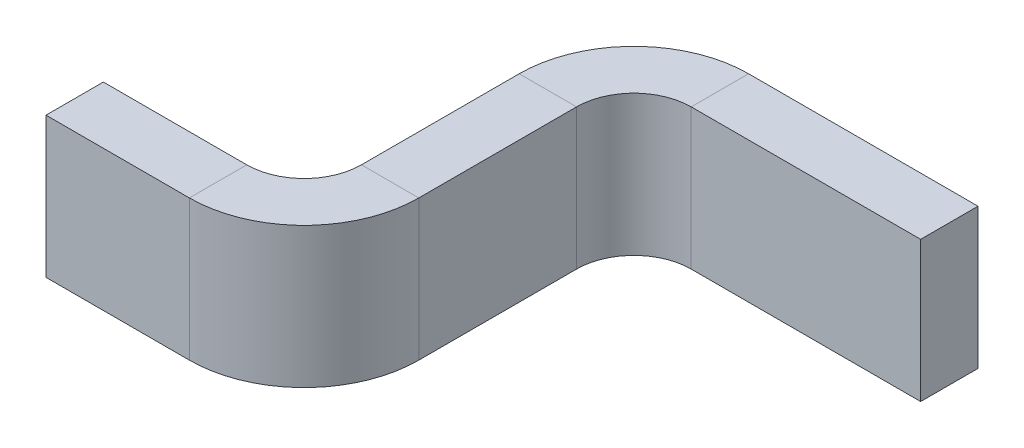
ISO-10303-21;
HEADER;
FILE_DESCRIPTION(('STEP AP214'),'2;1');
FILE_NAME('part.step','',(''),(''),'','','');
FILE_SCHEMA(('AUTOMOTIVE_DESIGN { 1 0 10303 214 1 1 1 1 }'));
ENDSEC;
DATA;
#1=APPLICATION_CONTEXT('core data for automotive mechanical design processes');
#2=APPLICATION_PROTOCOL_DEFINITION('international standard','automotive_design',2000,#1);
#3=PRODUCT_CONTEXT('',#1,'mechanical');
#4=PRODUCT('Part','Part','',(#3));
#5=PRODUCT_RELATED_PRODUCT_CATEGORY('part','',(#4));
#6=PRODUCT_DEFINITION_FORMATION('','',#4);
#7=PRODUCT_DEFINITION_CONTEXT('part definition',#1,'design');
#8=PRODUCT_DEFINITION('design','',#6,#7);
#9=PRODUCT_DEFINITION_SHAPE('','',#8);
#10=(LENGTH_UNIT() NAMED_UNIT(*) SI_UNIT(.MILLI.,.METRE.));
#11=(NAMED_UNIT(*) PLANE_ANGLE_UNIT() SI_UNIT($,.RADIAN.));
#12=(NAMED_UNIT(*) SI_UNIT($,.STERADIAN.) SOLID_ANGLE_UNIT());
#13=UNCERTAINTY_MEASURE_WITH_UNIT(LENGTH_MEASURE(1.E-05),#10,'distance_accuracy_value','');
#14=(GEOMETRIC_REPRESENTATION_CONTEXT(3) GLOBAL_UNCERTAINTY_ASSIGNED_CONTEXT((#13)) GLOBAL_UNIT_ASSIGNED_CONTEXT((#10,
#11,#12)) REPRESENTATION_CONTEXT('',''));
#15=CARTESIAN_POINT('',(0.,0.,0.));
#16=DIRECTION('',(0.,0.,1.));
#17=DIRECTION('',(1.,0.,0.));
#18=AXIS2_PLACEMENT_3D('',#15,#16,#17);
#19=CARTESIAN_POINT('',(0.95,-0.1225,0.));
#20=DIRECTION('',(-1.,0.,0.));
#21=DIRECTION('',(0.,0.,1.));
#22=AXIS2_PLACEMENT_3D('',#19,#20,#21);
#23=PLANE('',#22);
#24=DIRECTION('',(0.,-1.,0.));
#25=VECTOR('',#24,1.);
#26=CARTESIAN_POINT('',(0.95,-0.1225,0.));
#27=LINE('',#26,#25);
#28=CARTESIAN_POINT('',(0.95,0.1225,0.));
#29=VERTEX_POINT('',#28);
#30=CARTESIAN_POINT('',(0.95,-0.1225,0.));
#31=VERTEX_POINT('',#30);
#32=EDGE_CURVE('E237',#29,#31,#27,.T.);
#33=ORIENTED_EDGE('',*,*,#32,.F.);
#34=DIRECTION('',(0.,0.,-1.));
#35=VECTOR('',#34,1.);
#36=CARTESIAN_POINT('',(0.95,0.1225,0.));
#37=LINE('',#36,#35);
#38=CARTESIAN_POINT('',(0.95,0.1225,0.1));
#39=VERTEX_POINT('',#38);
#40=EDGE_CURVE('E11',#39,#29,#37,.T.);
#41=ORIENTED_EDGE('',*,*,#40,.F.);
#42=DIRECTION('',(0.,1.,0.));
#43=VECTOR('',#42,1.);
#44=CARTESIAN_POINT('',(0.95,0.1225,0.1));
#45=LINE('',#44,#43);
#46=CARTESIAN_POINT('',(0.95,-0.1225,0.1));
#47=VERTEX_POINT('',#46);
#48=EDGE_CURVE('E245',#47,#39,#45,.T.);
#49=ORIENTED_EDGE('',*,*,#48,.F.);
#50=DIRECTION('',(0.,0.,1.));
#51=VECTOR('',#50,1.);
#52=CARTESIAN_POINT('',(0.95,-0.1225,0.1));
#53=LINE('',#52,#51);
#54=EDGE_CURVE('E197',#31,#47,#53,.T.);
#55=ORIENTED_EDGE('',*,*,#54,.F.);
#56=EDGE_LOOP('',(#33,#41,#49,#55));
#57=FACE_BOUND('',#56,.T.);
#58=ADVANCED_FACE('F16',(#57),#23,.F.);
#59=CARTESIAN_POINT('',(0.55,0.1225,0.));
#60=DIRECTION('',(0.,-1.,0.));
#61=DIRECTION('',(0.,0.,-1.));
#62=AXIS2_PLACEMENT_3D('',#59,#60,#61);
#63=PLANE('',#62);
#64=DIRECTION('',(1.,0.,0.));
#65=VECTOR('',#64,1.);
#66=CARTESIAN_POINT('',(0.55,0.1225,0.1));
#67=LINE('',#66,#65);
#68=CARTESIAN_POINT('',(0.55,0.1225,0.1));
#69=VERTEX_POINT('',#68);
#70=EDGE_CURVE('E187',#69,#39,#67,.T.);
#71=ORIENTED_EDGE('',*,*,#70,.T.);
#72=ORIENTED_EDGE('',*,*,#40,.T.);
#73=DIRECTION('',(1.,0.,0.));
#74=VECTOR('',#73,1.);
#75=CARTESIAN_POINT('',(0.55,0.1225,0.));
#76=LINE('',#75,#74);
#77=CARTESIAN_POINT('',(0.55,0.1225,0.));
#78=VERTEX_POINT('',#77);
#79=EDGE_CURVE('E156',#78,#29,#76,.T.);
#80=ORIENTED_EDGE('',*,*,#79,.F.);
#81=DIRECTION('',(0.,0.,-1.));
#82=VECTOR('',#81,1.);
#83=CARTESIAN_POINT('',(0.55,0.1225,0.));
#84=LINE('',#83,#82);
#85=EDGE_CURVE('E27',#69,#78,#84,.T.);
#86=ORIENTED_EDGE('',*,*,#85,.F.);
#87=EDGE_LOOP('',(#71,#72,#80,#86));
#88=FACE_BOUND('',#87,.T.);
#89=ADVANCED_FACE('F654',(#88),#63,.F.);
#90=CARTESIAN_POINT('',(0.443933982822,0.1225,0.09393398282202));
#91=DIRECTION('',(0.,1.,0.));
#92=DIRECTION('',(1.,0.,0.));
#93=AXIS2_PLACEMENT_3D('',#90,#91,#92);
#94=PLANE('',#93);
#95=CARTESIAN_POINT('',(0.55,0.1225,0.2));
#96=DIRECTION('',(0.,-1.,0.));
#97=DIRECTION('',(0.,0.,-1.));
#98=AXIS2_PLACEMENT_3D('',#95,#96,#97);
#99=CIRCLE('',#98,0.1);
#100=CARTESIAN_POINT('',(0.45,0.1225,0.2));
#101=VERTEX_POINT('',#100);
#102=EDGE_CURVE('E241',#101,#69,#99,.T.);
#103=ORIENTED_EDGE('',*,*,#102,.T.);
#104=ORIENTED_EDGE('',*,*,#85,.T.);
#105=CARTESIAN_POINT('',(0.55,0.1225,0.2));
#106=DIRECTION('',(0.,-1.,0.));
#107=DIRECTION('',(0.,0.,-1.));
#108=AXIS2_PLACEMENT_3D('',#105,#106,#107);
#109=CIRCLE('',#108,0.2);
#110=CARTESIAN_POINT('',(0.35,0.1225,0.2));
#111=VERTEX_POINT('',#110);
#112=EDGE_CURVE('E167',#111,#78,#109,.T.);
#113=ORIENTED_EDGE('',*,*,#112,.F.);
#114=DIRECTION('',(-1.,0.,0.));
#115=VECTOR('',#114,1.);
#116=CARTESIAN_POINT('',(0.35,0.1225,0.2));
#117=LINE('',#116,#115);
#118=EDGE_CURVE('E246',#101,#111,#117,.T.);
#119=ORIENTED_EDGE('',*,*,#118,.F.);
#120=EDGE_LOOP('',(#103,#104,#113,#119));
#121=FACE_BOUND('',#120,.T.);
#122=ADVANCED_FACE('F644',(#121),#94,.T.);
#123=CARTESIAN_POINT('',(0.35,0.1225,0.475));
#124=DIRECTION('',(0.,-1.,0.));
#125=DIRECTION('',(0.,0.,-1.));
#126=AXIS2_PLACEMENT_3D('',#123,#124,#125);
#127=PLANE('',#126);
#128=DIRECTION('',(0.,0.,-1.));
#129=VECTOR('',#128,1.);
#130=CARTESIAN_POINT('',(0.45,0.1225,0.475));
#131=LINE('',#130,#129);
#132=CARTESIAN_POINT('',(0.45,0.1225,0.475));
#133=VERTEX_POINT('',#132);
#134=EDGE_CURVE('E192',#133,#101,#131,.T.);
#135=ORIENTED_EDGE('',*,*,#134,.T.);
#136=ORIENTED_EDGE('',*,*,#118,.T.);
#137=DIRECTION('',(0.,0.,-1.));
#138=VECTOR('',#137,1.);
#139=CARTESIAN_POINT('',(0.35,0.1225,0.475));
#140=LINE('',#139,#138);
#141=CARTESIAN_POINT('',(0.35,0.1225,0.475));
#142=VERTEX_POINT('',#141);
#143=EDGE_CURVE('E170',#142,#111,#140,.T.);
#144=ORIENTED_EDGE('',*,*,#143,.F.);
#145=DIRECTION('',(-1.,0.,0.));
#146=VECTOR('',#145,1.);
#147=CARTESIAN_POINT('',(0.35,0.1225,0.475));
#148=LINE('',#147,#146);
#149=EDGE_CURVE('E186',#133,#142,#148,.T.);
#150=ORIENTED_EDGE('',*,*,#149,.F.);
#151=EDGE_LOOP('',(#135,#136,#144,#150));
#152=FACE_BOUND('',#151,.T.);
#153=ADVANCED_FACE('F634',(#152),#127,.F.);
#154=CARTESIAN_POINT('',(0.356066017178,0.1225,0.581066017178));
#155=DIRECTION('',(0.,1.,0.));
#156=DIRECTION('',(1.,0.,0.));
#157=AXIS2_PLACEMENT_3D('',#154,#155,#156);
#158=PLANE('',#157);
#159=CARTESIAN_POINT('',(0.25,0.1225,0.475));
#160=DIRECTION('',(0.,1.,0.));
#161=DIRECTION('',(0.,0.,-1.));
#162=AXIS2_PLACEMENT_3D('',#159,#160,#161);
#163=CIRCLE('',#162,0.2);
#164=CARTESIAN_POINT('',(0.25,0.1225,0.675));
#165=VERTEX_POINT('',#164);
#166=EDGE_CURVE('E193',#165,#133,#163,.T.);
#167=ORIENTED_EDGE('',*,*,#166,.T.);
#168=ORIENTED_EDGE('',*,*,#149,.T.);
#169=CARTESIAN_POINT('',(0.25,0.1225,0.475));
#170=DIRECTION('',(0.,1.,0.));
#171=DIRECTION('',(0.,0.,-1.));
#172=AXIS2_PLACEMENT_3D('',#169,#170,#171);
#173=CIRCLE('',#172,0.1);
#174=CARTESIAN_POINT('',(0.25,0.1225,0.575));
#175=VERTEX_POINT('',#174);
#176=EDGE_CURVE('E254',#175,#142,#173,.T.);
#177=ORIENTED_EDGE('',*,*,#176,.F.);
#178=DIRECTION('',(0.,0.,-1.));
#179=VECTOR('',#178,1.);
#180=CARTESIAN_POINT('',(0.25,0.1225,0.575));
#181=LINE('',#180,#179);
#182=EDGE_CURVE('E183',#165,#175,#181,.T.);
#183=ORIENTED_EDGE('',*,*,#182,.F.);
#184=EDGE_LOOP('',(#167,#168,#177,#183));
#185=FACE_BOUND('',#184,.T.);
#186=ADVANCED_FACE('F624',(#185),#158,.T.);
#187=CARTESIAN_POINT('',(0.,0.1225,0.575));
#188=DIRECTION('',(0.,-1.,0.));
#189=DIRECTION('',(0.,0.,-1.));
#190=AXIS2_PLACEMENT_3D('',#187,#188,#189);
#191=PLANE('',#190);
#192=DIRECTION('',(1.,0.,0.));
#193=VECTOR('',#192,1.);
#194=CARTESIAN_POINT('',(0.,0.1225,0.675));
#195=LINE('',#194,#193);
#196=CARTESIAN_POINT('',(0.,0.1225,0.675));
#197=VERTEX_POINT('',#196);
#198=EDGE_CURVE('E258',#197,#165,#195,.T.);
#199=ORIENTED_EDGE('',*,*,#198,.T.);
#200=ORIENTED_EDGE('',*,*,#182,.T.);
#201=DIRECTION('',(1.,0.,0.));
#202=VECTOR('',#201,1.);
#203=CARTESIAN_POINT('',(0.,0.1225,0.575));
#204=LINE('',#203,#202);
#205=CARTESIAN_POINT('',(0.,0.1225,0.575));
#206=VERTEX_POINT('',#205);
#207=EDGE_CURVE('E219',#206,#175,#204,.T.);
#208=ORIENTED_EDGE('',*,*,#207,.F.);
#209=DIRECTION('',(0.,0.,-1.));
#210=VECTOR('',#209,1.);
#211=CARTESIAN_POINT('',(0.,0.1225,0.575));
#212=LINE('',#211,#210);
#213=EDGE_CURVE('E20',#197,#206,#212,.T.);
#214=ORIENTED_EDGE('',*,*,#213,.F.);
#215=EDGE_LOOP('',(#199,#200,#208,#214));
#216=FACE_BOUND('',#215,.T.);
#217=ADVANCED_FACE('F329',(#216),#191,.F.);
#218=CARTESIAN_POINT('',(0.55,0.1225,0.1));
#219=DIRECTION('',(0.,0.,-1.));
#220=DIRECTION('',(0.,-1.,0.));
#221=AXIS2_PLACEMENT_3D('',#218,#219,#220);
#222=PLANE('',#221);
#223=DIRECTION('',(1.,0.,0.));
#224=VECTOR('',#223,1.);
#225=CARTESIAN_POINT('',(0.55,-0.1225,0.1));
#226=LINE('',#225,#224);
#227=CARTESIAN_POINT('',(0.55,-0.1225,0.1));
#228=VERTEX_POINT('',#227);
#229=EDGE_CURVE('E200',#228,#47,#226,.T.);
#230=ORIENTED_EDGE('',*,*,#229,.T.);
#231=ORIENTED_EDGE('',*,*,#48,.T.);
#232=ORIENTED_EDGE('',*,*,#70,.F.);
#233=DIRECTION('',(0.,-1.,0.));
#234=VECTOR('',#233,1.);
#235=CARTESIAN_POINT('',(0.55,0.1225,0.1));
#236=LINE('',#235,#234);
#237=EDGE_CURVE('E196',#69,#228,#236,.T.);
#238=ORIENTED_EDGE('',*,*,#237,.T.);
#239=EDGE_LOOP('',(#230,#231,#232,#238));
#240=FACE_BOUND('',#239,.T.);
#241=ADVANCED_FACE('F606',(#240),#222,.F.);
#242=CARTESIAN_POINT('',(0.55,0.1225,0.2));
#243=DIRECTION('',(0.,-1.,0.));
#244=DIRECTION('',(0.,0.,-1.));
#245=AXIS2_PLACEMENT_3D('',#242,#243,#244);
#246=CYLINDRICAL_SURFACE('',#245,0.1);
#247=CARTESIAN_POINT('',(0.55,-0.1225,0.2));
#248=DIRECTION('',(0.,-1.,0.));
#249=DIRECTION('',(0.,0.,-1.));
#250=AXIS2_PLACEMENT_3D('',#247,#248,#249);
#251=CIRCLE('',#250,0.1);
#252=CARTESIAN_POINT('',(0.45,-0.1225,0.2));
#253=VERTEX_POINT('',#252);
#254=EDGE_CURVE('E137',#253,#228,#251,.T.);
#255=ORIENTED_EDGE('',*,*,#254,.T.);
#256=ORIENTED_EDGE('',*,*,#237,.F.);
#257=ORIENTED_EDGE('',*,*,#102,.F.);
#258=DIRECTION('',(0.,1.,0.));
#259=VECTOR('',#258,1.);
#260=CARTESIAN_POINT('',(0.45,0.1225,0.2));
#261=LINE('',#260,#259);
#262=EDGE_CURVE('E188',#253,#101,#261,.T.);
#263=ORIENTED_EDGE('',*,*,#262,.F.);
#264=EDGE_LOOP('',(#255,#256,#257,#263));
#265=FACE_BOUND('',#264,.T.);
#266=ADVANCED_FACE('F597',(#265),#246,.F.);
#267=CARTESIAN_POINT('',(0.45,0.1225,0.475));
#268=DIRECTION('',(-1.,0.,0.));
#269=DIRECTION('',(0.,0.,1.));
#270=AXIS2_PLACEMENT_3D('',#267,#268,#269);
#271=PLANE('',#270);
#272=DIRECTION('',(0.,0.,-1.));
#273=VECTOR('',#272,1.);
#274=CARTESIAN_POINT('',(0.45,-0.1225,0.475));
#275=LINE('',#274,#273);
#276=CARTESIAN_POINT('',(0.45,-0.1225,0.475));
#277=VERTEX_POINT('',#276);
#278=EDGE_CURVE('E143',#277,#253,#275,.T.);
#279=ORIENTED_EDGE('',*,*,#278,.T.);
#280=ORIENTED_EDGE('',*,*,#262,.T.);
#281=ORIENTED_EDGE('',*,*,#134,.F.);
#282=DIRECTION('',(0.,1.,0.));
#283=VECTOR('',#282,1.);
#284=CARTESIAN_POINT('',(0.45,0.1225,0.475));
#285=LINE('',#284,#283);
#286=EDGE_CURVE('E226',#277,#133,#285,.T.);
#287=ORIENTED_EDGE('',*,*,#286,.F.);
#288=EDGE_LOOP('',(#279,#280,#281,#287));
#289=FACE_BOUND('',#288,.T.);
#290=ADVANCED_FACE('F587',(#289),#271,.F.);
#291=CARTESIAN_POINT('',(0.25,0.1225,0.475));
#292=DIRECTION('',(0.,1.,0.));
#293=DIRECTION('',(0.,0.,-1.));
#294=AXIS2_PLACEMENT_3D('',#291,#292,#293);
#295=CYLINDRICAL_SURFACE('',#294,0.2);
#296=CARTESIAN_POINT('',(0.25,-0.1225,0.475));
#297=DIRECTION('',(0.,1.,0.));
#298=DIRECTION('',(0.,0.,-1.));
#299=AXIS2_PLACEMENT_3D('',#296,#297,#298);
#300=CIRCLE('',#299,0.2);
#301=CARTESIAN_POINT('',(0.25,-0.1225,0.675));
#302=VERTEX_POINT('',#301);
#303=EDGE_CURVE('E144',#302,#277,#300,.T.);
#304=ORIENTED_EDGE('',*,*,#303,.T.);
#305=ORIENTED_EDGE('',*,*,#286,.T.);
#306=ORIENTED_EDGE('',*,*,#166,.F.);
#307=DIRECTION('',(0.,1.,0.));
#308=VECTOR('',#307,1.);
#309=CARTESIAN_POINT('',(0.25,0.1225,0.675));
#310=LINE('',#309,#308);
#311=EDGE_CURVE('E209',#302,#165,#310,.T.);
#312=ORIENTED_EDGE('',*,*,#311,.F.);
#313=EDGE_LOOP('',(#304,#305,#306,#312));
#314=FACE_BOUND('',#313,.T.);
#315=ADVANCED_FACE('F577',(#314),#295,.T.);
#316=CARTESIAN_POINT('',(0.,0.1225,0.675));
#317=DIRECTION('',(0.,0.,-1.));
#318=DIRECTION('',(0.,-1.,0.));
#319=AXIS2_PLACEMENT_3D('',#316,#317,#318);
#320=PLANE('',#319);
#321=DIRECTION('',(1.,0.,0.));
#322=VECTOR('',#321,1.);
#323=CARTESIAN_POINT('',(0.,-0.1225,0.675));
#324=LINE('',#323,#322);
#325=CARTESIAN_POINT('',(0.,-0.1225,0.675));
#326=VERTEX_POINT('',#325);
#327=EDGE_CURVE('E181',#326,#302,#324,.T.);
#328=ORIENTED_EDGE('',*,*,#327,.T.);
#329=ORIENTED_EDGE('',*,*,#311,.T.);
#330=ORIENTED_EDGE('',*,*,#198,.F.);
#331=DIRECTION('',(0.,1.,0.));
#332=VECTOR('',#331,1.);
#333=CARTESIAN_POINT('',(0.,0.1225,0.675));
#334=LINE('',#333,#332);
#335=EDGE_CURVE('E232',#326,#197,#334,.T.);
#336=ORIENTED_EDGE('',*,*,#335,.F.);
#337=EDGE_LOOP('',(#328,#329,#330,#336));
#338=FACE_BOUND('',#337,.T.);
#339=ADVANCED_FACE('F327',(#338),#320,.F.);
#340=CARTESIAN_POINT('',(0.55,-0.1225,0.1));
#341=DIRECTION('',(0.,1.,0.));
#342=DIRECTION('',(1.,0.,0.));
#343=AXIS2_PLACEMENT_3D('',#340,#341,#342);
#344=PLANE('',#343);
#345=DIRECTION('',(1.,0.,0.));
#346=VECTOR('',#345,1.);
#347=CARTESIAN_POINT('',(0.55,-0.1225,0.));
#348=LINE('',#347,#346);
#349=CARTESIAN_POINT('',(0.55,-0.1225,0.));
#350=VERTEX_POINT('',#349);
#351=EDGE_CURVE('E280',#350,#31,#348,.T.);
#352=ORIENTED_EDGE('',*,*,#351,.T.);
#353=ORIENTED_EDGE('',*,*,#54,.T.);
#354=ORIENTED_EDGE('',*,*,#229,.F.);
#355=DIRECTION('',(0.,0.,1.));
#356=VECTOR('',#355,1.);
#357=CARTESIAN_POINT('',(0.55,-0.1225,0.1));
#358=LINE('',#357,#356);
#359=EDGE_CURVE('E210',#350,#228,#358,.T.);
#360=ORIENTED_EDGE('',*,*,#359,.F.);
#361=EDGE_LOOP('',(#352,#353,#354,#360));
#362=FACE_BOUND('',#361,.T.);
#363=ADVANCED_FACE('F558',(#362),#344,.F.);
#364=CARTESIAN_POINT('',(0.443933982822,-0.1225,0.09393398282202));
#365=DIRECTION('',(0.,-1.,0.));
#366=DIRECTION('',(0.,0.,-1.));
#367=AXIS2_PLACEMENT_3D('',#364,#365,#366);
#368=PLANE('',#367);
#369=CARTESIAN_POINT('',(0.55,-0.1225,0.2));
#370=DIRECTION('',(0.,-1.,0.));
#371=DIRECTION('',(0.,0.,-1.));
#372=AXIS2_PLACEMENT_3D('',#369,#370,#371);
#373=CIRCLE('',#372,0.2);
#374=CARTESIAN_POINT('',(0.35,-0.1225,0.2));
#375=VERTEX_POINT('',#374);
#376=EDGE_CURVE('E134',#375,#350,#373,.T.);
#377=ORIENTED_EDGE('',*,*,#376,.T.);
#378=ORIENTED_EDGE('',*,*,#359,.T.);
#379=ORIENTED_EDGE('',*,*,#254,.F.);
#380=DIRECTION('',(1.,0.,0.));
#381=VECTOR('',#380,1.);
#382=CARTESIAN_POINT('',(0.45,-0.1225,0.2));
#383=LINE('',#382,#381);
#384=EDGE_CURVE('E130',#375,#253,#383,.T.);
#385=ORIENTED_EDGE('',*,*,#384,.F.);
#386=EDGE_LOOP('',(#377,#378,#379,#385));
#387=FACE_BOUND('',#386,.T.);
#388=ADVANCED_FACE('F132',(#387),#368,.T.);
#389=CARTESIAN_POINT('',(0.45,-0.1225,0.475));
#390=DIRECTION('',(0.,1.,0.));
#391=DIRECTION('',(1.,0.,0.));
#392=AXIS2_PLACEMENT_3D('',#389,#390,#391);
#393=PLANE('',#392);
#394=DIRECTION('',(0.,0.,-1.));
#395=VECTOR('',#394,1.);
#396=CARTESIAN_POINT('',(0.35,-0.1225,0.475));
#397=LINE('',#396,#395);
#398=CARTESIAN_POINT('',(0.35,-0.1225,0.475));
#399=VERTEX_POINT('',#398);
#400=EDGE_CURVE('E159',#399,#375,#397,.T.);
#401=ORIENTED_EDGE('',*,*,#400,.T.);
#402=ORIENTED_EDGE('',*,*,#384,.T.);
#403=ORIENTED_EDGE('',*,*,#278,.F.);
#404=DIRECTION('',(1.,0.,0.));
#405=VECTOR('',#404,1.);
#406=CARTESIAN_POINT('',(0.45,-0.1225,0.475));
#407=LINE('',#406,#405);
#408=EDGE_CURVE('E162',#399,#277,#407,.T.);
#409=ORIENTED_EDGE('',*,*,#408,.F.);
#410=EDGE_LOOP('',(#401,#402,#403,#409));
#411=FACE_BOUND('',#410,.T.);
#412=ADVANCED_FACE('F160',(#411),#393,.F.);
#413=CARTESIAN_POINT('',(0.356066017178,-0.1225,0.581066017178));
#414=DIRECTION('',(0.,-1.,0.));
#415=DIRECTION('',(0.,0.,-1.));
#416=AXIS2_PLACEMENT_3D('',#413,#414,#415);
#417=PLANE('',#416);
#418=CARTESIAN_POINT('',(0.25,-0.1225,0.475));
#419=DIRECTION('',(0.,1.,0.));
#420=DIRECTION('',(0.,0.,-1.));
#421=AXIS2_PLACEMENT_3D('',#418,#419,#420);
#422=CIRCLE('',#421,0.1);
#423=CARTESIAN_POINT('',(0.25,-0.1225,0.575));
#424=VERTEX_POINT('',#423);
#425=EDGE_CURVE('E177',#424,#399,#422,.T.);
#426=ORIENTED_EDGE('',*,*,#425,.T.);
#427=ORIENTED_EDGE('',*,*,#408,.T.);
#428=ORIENTED_EDGE('',*,*,#303,.F.);
#429=DIRECTION('',(0.,0.,1.));
#430=VECTOR('',#429,1.);
#431=CARTESIAN_POINT('',(0.25,-0.1225,0.675));
#432=LINE('',#431,#430);
#433=EDGE_CURVE('E281',#424,#302,#432,.T.);
#434=ORIENTED_EDGE('',*,*,#433,.F.);
#435=EDGE_LOOP('',(#426,#427,#428,#434));
#436=FACE_BOUND('',#435,.T.);
#437=ADVANCED_FACE('F529',(#436),#417,.T.);
#438=CARTESIAN_POINT('',(0.,-0.1225,0.675));
#439=DIRECTION('',(0.,1.,0.));
#440=DIRECTION('',(1.,0.,0.));
#441=AXIS2_PLACEMENT_3D('',#438,#439,#440);
#442=PLANE('',#441);
#443=DIRECTION('',(1.,0.,0.));
#444=VECTOR('',#443,1.);
#445=CARTESIAN_POINT('',(0.,-0.1225,0.575));
#446=LINE('',#445,#444);
#447=CARTESIAN_POINT('',(0.,-0.1225,0.575));
#448=VERTEX_POINT('',#447);
#449=EDGE_CURVE('E270',#448,#424,#446,.T.);
#450=ORIENTED_EDGE('',*,*,#449,.T.);
#451=ORIENTED_EDGE('',*,*,#433,.T.);
#452=ORIENTED_EDGE('',*,*,#327,.F.);
#453=DIRECTION('',(0.,0.,1.));
#454=VECTOR('',#453,1.);
#455=CARTESIAN_POINT('',(0.,-0.1225,0.675));
#456=LINE('',#455,#454);
#457=EDGE_CURVE('E228',#448,#326,#456,.T.);
#458=ORIENTED_EDGE('',*,*,#457,.F.);
#459=EDGE_LOOP('',(#450,#451,#452,#458));
#460=FACE_BOUND('',#459,.T.);
#461=ADVANCED_FACE('F321',(#460),#442,.F.);
#462=CARTESIAN_POINT('',(0.55,-0.1225,0.));
#463=DIRECTION('',(0.,0.,1.));
#464=DIRECTION('',(1.,0.,0.));
#465=AXIS2_PLACEMENT_3D('',#462,#463,#464);
#466=PLANE('',#465);
#467=ORIENTED_EDGE('',*,*,#79,.T.);
#468=ORIENTED_EDGE('',*,*,#32,.T.);
#469=ORIENTED_EDGE('',*,*,#351,.F.);
#470=DIRECTION('',(0.,-1.,0.));
#471=VECTOR('',#470,1.);
#472=CARTESIAN_POINT('',(0.55,-0.1225,0.));
#473=LINE('',#472,#471);
#474=EDGE_CURVE('E154',#78,#350,#473,.T.);
#475=ORIENTED_EDGE('',*,*,#474,.F.);
#476=EDGE_LOOP('',(#467,#468,#469,#475));
#477=FACE_BOUND('',#476,.T.);
#478=ADVANCED_FACE('F507',(#477),#466,.F.);
#479=CARTESIAN_POINT('',(0.55,-0.1225,0.2));
#480=DIRECTION('',(0.,-1.,0.));
#481=DIRECTION('',(0.,0.,-1.));
#482=AXIS2_PLACEMENT_3D('',#479,#480,#481);
#483=CYLINDRICAL_SURFACE('',#482,0.2);
#484=ORIENTED_EDGE('',*,*,#112,.T.);
#485=ORIENTED_EDGE('',*,*,#474,.T.);
#486=ORIENTED_EDGE('',*,*,#376,.F.);
#487=DIRECTION('',(0.,-1.,0.));
#488=VECTOR('',#487,1.);
#489=CARTESIAN_POINT('',(0.35,-0.1225,0.2));
#490=LINE('',#489,#488);
#491=EDGE_CURVE('E151',#111,#375,#490,.T.);
#492=ORIENTED_EDGE('',*,*,#491,.F.);
#493=EDGE_LOOP('',(#484,#485,#486,#492));
#494=FACE_BOUND('',#493,.T.);
#495=ADVANCED_FACE('F149',(#494),#483,.T.);
#496=CARTESIAN_POINT('',(0.35,-0.1225,0.475));
#497=DIRECTION('',(1.,0.,0.));
#498=DIRECTION('',(0.,1.,0.));
#499=AXIS2_PLACEMENT_3D('',#496,#497,#498);
#500=PLANE('',#499);
#501=ORIENTED_EDGE('',*,*,#143,.T.);
#502=ORIENTED_EDGE('',*,*,#491,.T.);
#503=ORIENTED_EDGE('',*,*,#400,.F.);
#504=DIRECTION('',(0.,1.,0.));
#505=VECTOR('',#504,1.);
#506=CARTESIAN_POINT('',(0.35,-0.1225,0.475));
#507=LINE('',#506,#505);
#508=EDGE_CURVE('E251',#399,#142,#507,.T.);
#509=ORIENTED_EDGE('',*,*,#508,.T.);
#510=EDGE_LOOP('',(#501,#502,#503,#509));
#511=FACE_BOUND('',#510,.T.);
#512=ADVANCED_FACE('F18',(#511),#500,.F.);
#513=CARTESIAN_POINT('',(0.25,-0.1225,0.475));
#514=DIRECTION('',(0.,1.,0.));
#515=DIRECTION('',(0.,0.,-1.));
#516=AXIS2_PLACEMENT_3D('',#513,#514,#515);
#517=CYLINDRICAL_SURFACE('',#516,0.1);
#518=ORIENTED_EDGE('',*,*,#176,.T.);
#519=ORIENTED_EDGE('',*,*,#508,.F.);
#520=ORIENTED_EDGE('',*,*,#425,.F.);
#521=DIRECTION('',(0.,-1.,0.));
#522=VECTOR('',#521,1.);
#523=CARTESIAN_POINT('',(0.25,-0.1225,0.575));
#524=LINE('',#523,#522);
#525=EDGE_CURVE('E223',#175,#424,#524,.T.);
#526=ORIENTED_EDGE('',*,*,#525,.F.);
#527=EDGE_LOOP('',(#518,#519,#520,#526));
#528=FACE_BOUND('',#527,.T.);
#529=ADVANCED_FACE('F477',(#528),#517,.F.);
#530=CARTESIAN_POINT('',(0.,-0.1225,0.575));
#531=DIRECTION('',(0.,0.,1.));
#532=DIRECTION('',(1.,0.,0.));
#533=AXIS2_PLACEMENT_3D('',#530,#531,#532);
#534=PLANE('',#533);
#535=ORIENTED_EDGE('',*,*,#207,.T.);
#536=ORIENTED_EDGE('',*,*,#525,.T.);
#537=ORIENTED_EDGE('',*,*,#449,.F.);
#538=DIRECTION('',(0.,-1.,0.));
#539=VECTOR('',#538,1.);
#540=CARTESIAN_POINT('',(0.,-0.1225,0.575));
#541=LINE('',#540,#539);
#542=EDGE_CURVE('E233',#206,#448,#541,.T.);
#543=ORIENTED_EDGE('',*,*,#542,.F.);
#544=EDGE_LOOP('',(#535,#536,#537,#543));
#545=FACE_BOUND('',#544,.T.);
#546=ADVANCED_FACE('F318',(#545),#534,.F.);
#547=CARTESIAN_POINT('',(0.,-0.1225,0.575));
#548=DIRECTION('',(-1.,0.,0.));
#549=DIRECTION('',(0.,0.,1.));
#550=AXIS2_PLACEMENT_3D('',#547,#548,#549);
#551=PLANE('',#550);
#552=ORIENTED_EDGE('',*,*,#542,.T.);
#553=ORIENTED_EDGE('',*,*,#457,.T.);
#554=ORIENTED_EDGE('',*,*,#335,.T.);
#555=ORIENTED_EDGE('',*,*,#213,.T.);
#556=EDGE_LOOP('',(#552,#553,#554,#555));
#557=FACE_BOUND('',#556,.T.);
#558=ADVANCED_FACE('F314',(#557),#551,.T.);
#559=CLOSED_SHELL('',(#58,#89,#122,#153,#186,#217,#241,#266,#290,#315,#339,#363,#388,#412,#437,
#461,#478,#495,#512,#529,#546,#558));
#560=MANIFOLD_SOLID_BREP('B1',#559);
#561=ADVANCED_BREP_SHAPE_REPRESENTATION('',(#18,#560),#14);
#562=SHAPE_DEFINITION_REPRESENTATION(#9,#561);
ENDSEC;
END-ISO-10303-21;
